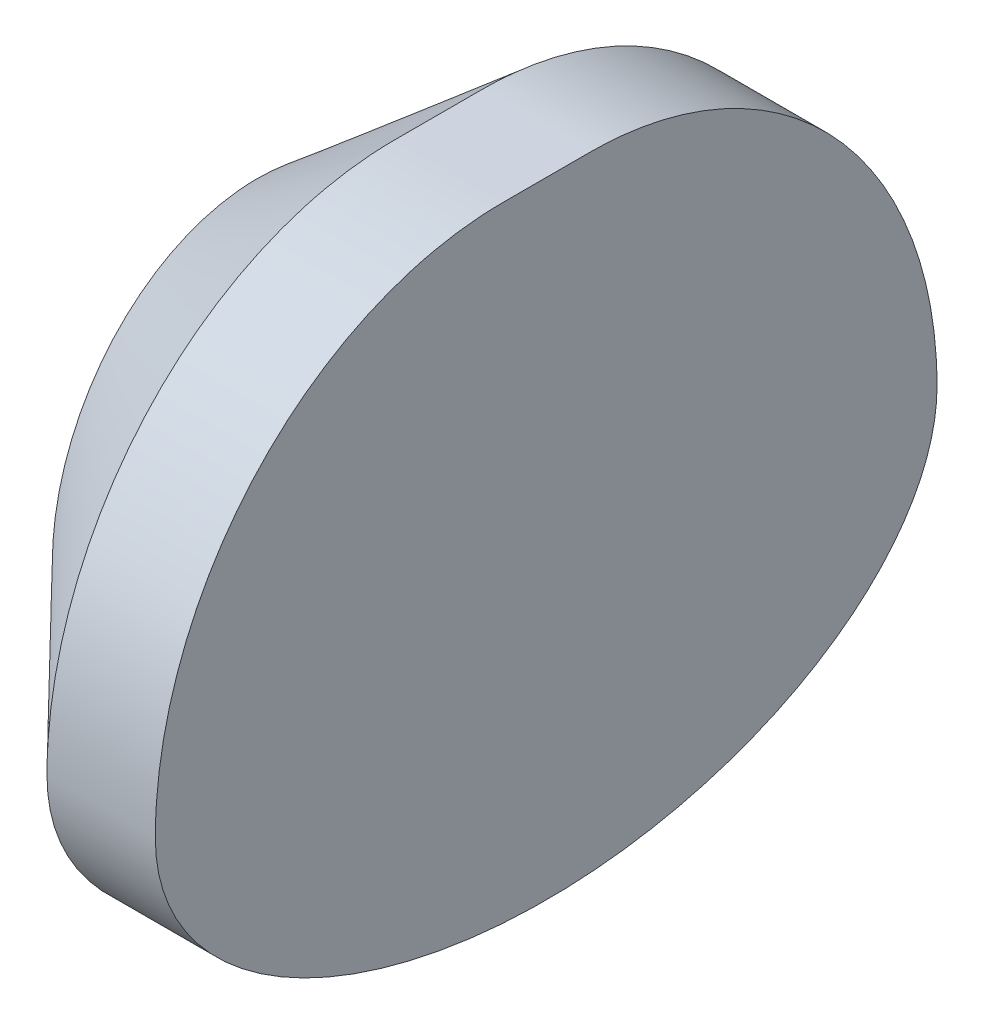
ISO-10303-21;
HEADER;
FILE_DESCRIPTION(('STEP AP214'),'2;1');
FILE_NAME('part.step','',(''),(''),'','','');
FILE_SCHEMA(('AUTOMOTIVE_DESIGN { 1 0 10303 214 1 1 1 1 }'));
ENDSEC;
DATA;
#1=APPLICATION_CONTEXT('core data for automotive mechanical design processes');
#2=APPLICATION_PROTOCOL_DEFINITION('international standard','automotive_design',2000,#1);
#3=PRODUCT_CONTEXT('',#1,'mechanical');
#4=PRODUCT('Part','Part','',(#3));
#5=PRODUCT_RELATED_PRODUCT_CATEGORY('part','',(#4));
#6=PRODUCT_DEFINITION_FORMATION('','',#4);
#7=PRODUCT_DEFINITION_CONTEXT('part definition',#1,'design');
#8=PRODUCT_DEFINITION('design','',#6,#7);
#9=PRODUCT_DEFINITION_SHAPE('','',#8);
#10=(LENGTH_UNIT() NAMED_UNIT(*) SI_UNIT(.MILLI.,.METRE.));
#11=(NAMED_UNIT(*) PLANE_ANGLE_UNIT() SI_UNIT($,.RADIAN.));
#12=(NAMED_UNIT(*) SI_UNIT($,.STERADIAN.) SOLID_ANGLE_UNIT());
#13=UNCERTAINTY_MEASURE_WITH_UNIT(LENGTH_MEASURE(1.E-05),#10,'distance_accuracy_value','');
#14=(GEOMETRIC_REPRESENTATION_CONTEXT(3) GLOBAL_UNCERTAINTY_ASSIGNED_CONTEXT((#13)) GLOBAL_UNIT_ASSIGNED_CONTEXT((#10,
#11,#12)) REPRESENTATION_CONTEXT('',''));
#15=CARTESIAN_POINT('',(0.,0.,0.));
#16=DIRECTION('',(0.,0.,1.));
#17=DIRECTION('',(1.,0.,0.));
#18=AXIS2_PLACEMENT_3D('',#15,#16,#17);
#19=CARTESIAN_POINT('',(0.,0.,0.));
#20=DIRECTION('',(1.,0.,0.));
#21=DIRECTION('',(0.,0.,-1.));
#22=AXIS2_PLACEMENT_3D('',#19,#20,#21);
#23=PLANE('',#22);
#24=CARTESIAN_POINT('',(0.,0.,0.));
#25=DIRECTION('',(1.,0.,0.));
#26=DIRECTION('',(0.,0.,-1.));
#27=AXIS2_PLACEMENT_3D('',#24,#25,#26);
#28=ELLIPSE('',#27,108.250610069917,69.0343094671072);
#29=CARTESIAN_POINT('',(0.,0.,108.250610069917));
#30=VERTEX_POINT('',#29);
#31=CARTESIAN_POINT('',(0.,-2.52169403102978E-09,-108.250610069644));
#32=VERTEX_POINT('',#31);
#33=EDGE_CURVE('E254',#30,#32,#28,.T.);
#34=ORIENTED_EDGE('',*,*,#33,.T.);
#35=CARTESIAN_POINT('',(0.,0.,-12.));
#36=DIRECTION('',(1.,0.,0.));
#37=DIRECTION('',(0.,1.,0.));
#38=AXIS2_PLACEMENT_3D('',#35,#36,#37);
#39=ELLIPSE('',#38,104.280609688491,96.2506100699173);
#40=CARTESIAN_POINT('',(0.,104.280609688491,-11.9999999986268));
#41=VERTEX_POINT('',#40);
#42=EDGE_CURVE('E250',#32,#41,#39,.T.);
#43=ORIENTED_EDGE('',*,*,#42,.T.);
#44=DIRECTION('',(0.,0.,1.));
#45=VECTOR('',#44,1.);
#46=CARTESIAN_POINT('',(0.,104.280609688491,-12.));
#47=LINE('',#46,#45);
#48=CARTESIAN_POINT('',(0.,104.280609688491,12.));
#49=VERTEX_POINT('',#48);
#50=EDGE_CURVE('E233',#41,#49,#47,.T.);
#51=ORIENTED_EDGE('',*,*,#50,.T.);
#52=CARTESIAN_POINT('',(0.,0.,12.));
#53=DIRECTION('',(1.,0.,0.));
#54=DIRECTION('',(0.,1.,0.));
#55=AXIS2_PLACEMENT_3D('',#52,#53,#54);
#56=ELLIPSE('',#55,104.280609688491,96.2506100699173);
#57=EDGE_CURVE('E12',#49,#30,#56,.T.);
#58=ORIENTED_EDGE('',*,*,#57,.T.);
#59=EDGE_LOOP('',(#34,#43,#51,#58));
#60=FACE_BOUND('',#59,.T.);
#61=ADVANCED_FACE('F219',(#60),#23,.T.);
#62=CARTESIAN_POINT('',(0.,104.280609688491,12.0000045013716));
#63=CARTESIAN_POINT('',(-30.,104.280609688491,12.0000045013716));
#64=CARTESIAN_POINT('',(0.,104.280609688491,10.));
#65=CARTESIAN_POINT('',(-30.,104.280609688491,10.));
#66=CARTESIAN_POINT('',(0.,104.280609688491,6.00000000000001));
#67=CARTESIAN_POINT('',(-30.,104.280609688491,6.00000000000001));
#68=CARTESIAN_POINT('',(0.,104.280609688491,0.));
#69=CARTESIAN_POINT('',(-30.,104.280609688491,0.));
#70=CARTESIAN_POINT('',(0.,104.280609688491,-5.99999999999999));
#71=CARTESIAN_POINT('',(-30.,104.280609688491,-5.99999999999999));
#72=CARTESIAN_POINT('',(0.,104.280609688491,-10.));
#73=CARTESIAN_POINT('',(-30.,104.280609688491,-10.));
#74=CARTESIAN_POINT('',(0.,104.280609688491,-18.5649997158969));
#75=CARTESIAN_POINT('',(-30.,104.280609688491,-18.5649997158969));
#76=CARTESIAN_POINT('',(0.,102.817298270843,-31.6942713146222));
#77=CARTESIAN_POINT('',(-29.9999999999999,102.817298270843,-31.6942713146222));
#78=CARTESIAN_POINT('',(0.,96.3830173087808,-50.4320678988774));
#79=CARTESIAN_POINT('',(-30.0000000000001,96.3830173087809,-50.4320678988774));
#80=CARTESIAN_POINT('',(0.,86.1363027743514,-67.3773640878985));
#81=CARTESIAN_POINT('',(-29.9999999999999,86.1363027743514,-67.3773640878985));
#82=CARTESIAN_POINT('',(0.,72.6733257732998,-81.8866282460188));
#83=CARTESIAN_POINT('',(-30.0000000000001,72.6733257732999,-81.8866282460188));
#84=CARTESIAN_POINT('',(0.,56.6659708026067,-93.5130472511675));
#85=CARTESIAN_POINT('',(-29.9999999999999,56.6659708026065,-93.5130472511674));
#86=CARTESIAN_POINT('',(0.,38.7899792325763,-101.973781400399));
#87=CARTESIAN_POINT('',(-30.,38.7899792325764,-101.973781400399));
#88=CARTESIAN_POINT('',(0.,19.6951036442129,-107.104934177411));
#89=CARTESIAN_POINT('',(-30.,19.6951036442128,-107.104934177411));
#90=CARTESIAN_POINT('',(0.,6.56499971589687,-108.250610069917));
#91=CARTESIAN_POINT('',(-30.,6.56499971589687,-108.250610069917));
#92=CARTESIAN_POINT('',(0.,-2.93641305432727,-108.250610069917));
#93=CARTESIAN_POINT('',(-30.,-2.93641305432727,-108.250610069917));
#94=CARTESIAN_POINT('',(0.,-8.80857263521676,-107.65802156483));
#95=CARTESIAN_POINT('',(-30.,-8.80857263521673,-107.65802156483));
#96=CARTESIAN_POINT('',(0.,-17.2745339384963,-105.086315600387));
#97=CARTESIAN_POINT('',(-30.,-17.2745339384963,-105.086315600386));
#98=CARTESIAN_POINT('',(0.,-25.151290681926,-101.075731999929));
#99=CARTESIAN_POINT('',(-30.,-25.151290681926,-101.07573199993));
#100=CARTESIAN_POINT('',(0.,-32.3150186110621,-95.9104366332548));
#101=CARTESIAN_POINT('',(-30.0000000000001,-32.3150186110623,-95.9104366332546));
#102=CARTESIAN_POINT('',(0.,-38.73178328446,-89.8512752283713));
#103=CARTESIAN_POINT('',(-29.9999999999999,-38.7317832844598,-89.8512752283715));
#104=CARTESIAN_POINT('',(0.,-44.4177421832335,-83.1063520688836));
#105=CARTESIAN_POINT('',(-30.0000000000001,-44.4177421832337,-83.1063520688834));
#106=CARTESIAN_POINT('',(0.,-49.4114646466377,-75.8387758370687));
#107=CARTESIAN_POINT('',(-29.9999999999999,-49.4114646466376,-75.8387758370687));
#108=CARTESIAN_POINT('',(0.,-55.2036516480983,-65.6075177527217));
#109=CARTESIAN_POINT('',(-30.0000000000001,-55.2036516480982,-65.6075177527217));
#110=CARTESIAN_POINT('',(0.,-60.9304225908419,-52.0490888699162));
#111=CARTESIAN_POINT('',(-29.9999999999999,-60.9304225908421,-52.0490888699163));
#112=CARTESIAN_POINT('',(0.,-65.6584891697275,-35.044808989351));
#113=CARTESIAN_POINT('',(-30.0000000000001,-65.6584891697274,-35.0448089893508));
#114=CARTESIAN_POINT('',(0.,-68.4264748382489,-17.6185244473056));
#115=CARTESIAN_POINT('',(-29.9999999999998,-68.4264748382489,-17.6185244473057));
#116=CARTESIAN_POINT('',(0.,-69.338097959213,0.));
#117=CARTESIAN_POINT('',(-30.0000000000002,-69.3380979592131,0.));
#118=CARTESIAN_POINT('',(0.,-68.4264748382489,17.618524447306));
#119=CARTESIAN_POINT('',(-29.9999999999997,-68.4264748382488,17.618524447306));
#120=CARTESIAN_POINT('',(0.,-65.6584891697274,35.0448089893509));
#121=CARTESIAN_POINT('',(-30.0000000000002,-65.6584891697274,35.0448089893508));
#122=CARTESIAN_POINT('',(0.,-60.9304225908421,52.0490888699167));
#123=CARTESIAN_POINT('',(-29.9999999999998,-60.9304225908421,52.0490888699167));
#124=CARTESIAN_POINT('',(0.,-55.203651648098,65.6075177527215));
#125=CARTESIAN_POINT('',(-30.0000000000001,-55.2036516480981,65.6075177527216));
#126=CARTESIAN_POINT('',(0.,-49.4114646466377,75.8387758370692));
#127=CARTESIAN_POINT('',(-29.9999999999999,-49.4114646466377,75.8387758370691));
#128=CARTESIAN_POINT('',(0.,-44.4177421832333,83.1063520688834));
#129=CARTESIAN_POINT('',(-30.,-44.4177421832334,83.1063520688833));
#130=CARTESIAN_POINT('',(0.,-38.7317832844598,89.8512752283718));
#131=CARTESIAN_POINT('',(-29.9999999999999,-38.7317832844598,89.8512752283718));
#132=CARTESIAN_POINT('',(0.,-32.3150186110621,95.9104366332548));
#133=CARTESIAN_POINT('',(-30.,-32.315018611062,95.9104366332548));
#134=CARTESIAN_POINT('',(0.,-25.1512906819256,101.075731999929));
#135=CARTESIAN_POINT('',(-30.,-25.1512906819259,101.075731999929));
#136=CARTESIAN_POINT('',(0.,-17.2745339384963,105.086315600387));
#137=CARTESIAN_POINT('',(-30.,-17.2745339384961,105.086315600387));
#138=CARTESIAN_POINT('',(0.,-8.80857263521649,107.658021564829));
#139=CARTESIAN_POINT('',(-30.,-8.80857263521652,107.65802156483));
#140=CARTESIAN_POINT('',(0.,-2.93641305432727,108.250610069917));
#141=CARTESIAN_POINT('',(-30.,-2.93641305432725,108.250610069917));
#142=CARTESIAN_POINT('',(0.,6.56499970384459,108.250610069917));
#143=CARTESIAN_POINT('',(-30.,6.56499970384462,108.250610069917));
#144=CARTESIAN_POINT('',(0.,19.6951036527659,107.104934177602));
#145=CARTESIAN_POINT('',(-29.9999999999999,19.6951036527659,107.104934177602));
#146=CARTESIAN_POINT('',(0.,38.7899792283937,101.97378140005));
#147=CARTESIAN_POINT('',(-30.,38.7899792283937,101.97378140005));
#148=CARTESIAN_POINT('',(0.,56.6659708048007,93.5130472518172));
#149=CARTESIAN_POINT('',(-30.,56.6659708048006,93.5130472518171));
#150=CARTESIAN_POINT('',(0.,72.6733257721366,81.8866282448071));
#151=CARTESIAN_POINT('',(-30.,72.6733257721365,81.8866282448072));
#152=CARTESIAN_POINT('',(0.,86.1363027749674,67.3773640901547));
#153=CARTESIAN_POINT('',(-30.,86.1363027749676,67.3773640901546));
#154=CARTESIAN_POINT('',(0.,96.3830173084529,50.4320678946271));
#155=CARTESIAN_POINT('',(-30.,96.3830173084526,50.4320678946273));
#156=CARTESIAN_POINT('',(0.,102.817298271021,31.6942713232343));
#157=CARTESIAN_POINT('',(-30.,102.817298271022,31.6942713232342));
#158=CARTESIAN_POINT('',(0.,104.280609688491,18.5649997038446));
#159=CARTESIAN_POINT('',(-30.,104.280609688491,18.5649997038446));
#160=CARTESIAN_POINT('',(0.,104.280609688491,12.0000045013716));
#161=CARTESIAN_POINT('',(-30.,104.280609688491,12.0000045013716));
#162=B_SPLINE_SURFACE_WITH_KNOTS('',3,1,((#62,#63),(#64,#65),(#66,#67),(#68,#69),(#70,#71),(#72,
#73),(#74,#75),(#76,#77),(#78,#79),(#80,#81),(#82,#83),(#84,#85),(#86,#87),(#88,#89),(#90,#91),
(#92,#93),(#94,#95),(#96,#97),(#98,#99),(#100,#101),(#102,#103),(#104,#105),(#106,#107),(#108,
#109),(#110,#111),(#112,#113),(#114,#115),(#116,#117),(#118,#119),(#120,#121),(#122,#123),(#124,
#125),(#126,#127),(#128,#129),(#130,#131),(#132,#133),(#134,#135),(#136,#137),(#138,#139),(#140,
#141),(#142,#143),(#144,#145),(#146,#147),(#148,#149),(#150,#151),(#152,#153),(#154,#155),(#156,
#157),(#158,#159),(#160,#161)),.UNSPECIFIED.,.T.,.F.,.F.,(4,1,1,1,2,1,1,1,1,1,1,1,2,1,1,1,1,1,1,
1,1,1,1,1,1,1,1,1,1,1,1,1,1,1,1,1,2,1,1,1,1,1,1,1,4),(2,2),(0.,0.00966128545777721,
0.0193225709155544,0.0289838563733316,0.0386451418311088,0.0703582193035876,0.102071296776066,
0.133784374248545,0.165497451721024,0.197210529193503,0.228923606665982,0.26063668413846,
0.292349761610939,0.306535562819635,0.320721364028332,0.334907165237028,0.349092966445724,
0.36327876765442,0.377464568863117,0.391650370071813,0.405836171280509,0.434207773697902,
0.462579376115294,0.490950978532687,0.519322580950079,0.547694183367472,0.576065785784864,
0.604437388202256,0.632808990619649,0.646994791828345,0.661180593037041,0.675366394245738,
0.689552195454434,0.70373799666313,0.717923797871826,0.732109599080522,0.746295400289219,
0.778008475253066,0.809721550216914,0.841434625180762,0.873147700144609,0.904860775108457,
0.936573850072305,0.968286925036152,1.),(0.,1.),.UNSPECIFIED.);
#163=CARTESIAN_POINT('',(-30.,0.,12.));
#164=DIRECTION('',(1.,0.,0.));
#165=DIRECTION('',(0.,1.,0.));
#166=AXIS2_PLACEMENT_3D('',#163,#164,#165);
#167=ELLIPSE('',#166,104.280609688491,96.2506100699173);
#168=CARTESIAN_POINT('',(-30.,104.280609688491,12.));
#169=VERTEX_POINT('',#168);
#170=CARTESIAN_POINT('',(-30.,0.,108.250610069917));
#171=VERTEX_POINT('',#170);
#172=EDGE_CURVE('E264',#169,#171,#167,.T.);
#173=CARTESIAN_POINT('',(-30.,0.,0.));
#174=DIRECTION('',(1.,0.,0.));
#175=DIRECTION('',(0.,0.,-1.));
#176=AXIS2_PLACEMENT_3D('',#173,#174,#175);
#177=ELLIPSE('',#176,108.250610069917,69.0343094671072);
#178=CARTESIAN_POINT('',(-30.,0.,-108.250610069645));
#179=VERTEX_POINT('',#178);
#180=EDGE_CURVE('E325',#171,#179,#177,.T.);
#181=CARTESIAN_POINT('',(-30.,0.,-12.));
#182=DIRECTION('',(1.,0.,0.));
#183=DIRECTION('',(0.,1.,0.));
#184=AXIS2_PLACEMENT_3D('',#181,#182,#183);
#185=ELLIPSE('',#184,104.280609688491,96.2506100699173);
#186=CARTESIAN_POINT('',(-30.,104.280609688491,-12.));
#187=VERTEX_POINT('',#186);
#188=EDGE_CURVE('E337',#179,#187,#185,.T.);
#189=DIRECTION('',(0.,0.,1.));
#190=VECTOR('',#189,1.);
#191=CARTESIAN_POINT('',(-30.,104.280609688491,-12.));
#192=LINE('',#191,#190);
#193=EDGE_CURVE('E226',#187,#169,#192,.T.);
#194=ORIENTED_EDGE('',*,*,#50,.F.);
#195=ORIENTED_EDGE('',*,*,#42,.F.);
#196=ORIENTED_EDGE('',*,*,#33,.F.);
#197=ORIENTED_EDGE('',*,*,#57,.F.);
#198=EDGE_LOOP('',(#194,#195,#196,#197));
#199=FACE_BOUND('',#198,.T.);
#200=ORIENTED_EDGE('',*,*,#172,.T.);
#201=ORIENTED_EDGE('',*,*,#180,.T.);
#202=ORIENTED_EDGE('',*,*,#188,.T.);
#203=ORIENTED_EDGE('',*,*,#193,.T.);
#204=EDGE_LOOP('',(#200,#201,#202,#203));
#205=FACE_BOUND('',#204,.T.);
#206=ADVANCED_FACE('F221',(#199,#205),#162,.T.);
#207=CARTESIAN_POINT('',(-80.,0.,0.));
#208=DIRECTION('',(-1.,0.,0.));
#209=DIRECTION('',(0.,0.,1.));
#210=AXIS2_PLACEMENT_3D('',#207,#208,#209);
#211=PLANE('',#210);
#212=CARTESIAN_POINT('',(-80.,0.,0.));
#213=DIRECTION('',(1.,0.,0.));
#214=DIRECTION('',(0.,0.,-1.));
#215=AXIS2_PLACEMENT_3D('',#212,#213,#214);
#216=ELLIPSE('',#215,56.7850257255924,39.8401104383333);
#217=CARTESIAN_POINT('',(-80.,0.,56.7850257255924));
#218=VERTEX_POINT('',#217);
#219=CARTESIAN_POINT('',(-80.,0.,-56.7850257255924));
#220=VERTEX_POINT('',#219);
#221=EDGE_CURVE('E385',#218,#220,#216,.T.);
#222=ORIENTED_EDGE('',*,*,#221,.F.);
#223=CARTESIAN_POINT('',(-80.,0.,0.));
#224=DIRECTION('',(1.,0.,0.));
#225=DIRECTION('',(0.,1.,0.));
#226=AXIS2_PLACEMENT_3D('',#223,#224,#225);
#227=ELLIPSE('',#226,64.034444356964,56.7850257255924);
#228=EDGE_CURVE('E379',#220,#218,#227,.T.);
#229=ORIENTED_EDGE('',*,*,#228,.F.);
#230=EDGE_LOOP('',(#222,#229));
#231=FACE_BOUND('',#230,.T.);
#232=ADVANCED_FACE('F282',(#231),#211,.T.);
#233=CARTESIAN_POINT('',(-30.,0.000154269071182475,-108.250610069917));
#234=CARTESIAN_POINT('',(-80.,3.10859499354828E-05,-56.7850257255924));
#235=CARTESIAN_POINT('',(-30.,-2.92102335544548,-108.250610069917));
#236=CARTESIAN_POINT('',(-80.,-1.60170210270246,-56.7850257255924));
#237=CARTESIAN_POINT('',(-30.,-8.76532859820134,-107.664248000249));
#238=CARTESIAN_POINT('',(-80.0000000000001,-4.80330873343349,-56.5081666374398));
#239=CARTESIAN_POINT('',(-30.,-17.201999459513,-105.113876633961));
#240=CARTESIAN_POINT('',(-79.9999999999998,-9.46228590244364,-55.2941361782841));
#241=CARTESIAN_POINT('',(-30.,-25.0621855080917,-101.12909276697));
#242=CARTESIAN_POINT('',(-80.,-13.8658629051846,-53.3652645444365));
#243=CARTESIAN_POINT('',(-30.,-32.2199172676221,-95.9885411560364));
#244=CARTESIAN_POINT('',(-80.,-17.9419361570296,-50.8272957506338));
#245=CARTESIAN_POINT('',(-30.,-38.6384554084994,-89.9498637760191));
#246=CARTESIAN_POINT('',(-80.0000000000001,-21.6528088003659,-47.7912498484992));
#247=CARTESIAN_POINT('',(-30.,-44.3314416338075,-83.2197288458799));
#248=CARTESIAN_POINT('',(-79.9999999999999,-24.9880968838281,-44.3510667342998));
#249=CARTESIAN_POINT('',(-30.,-49.335406174274,-75.9608024148637));
#250=CARTESIAN_POINT('',(-80.,-27.9496199814091,-40.5937611807784));
#251=CARTESIAN_POINT('',(-29.9999999999999,-55.1435735709636,-65.7331032405262));
#252=CARTESIAN_POINT('',(-80.0000000000001,-31.4175100390852,-35.2404263597367));
#253=CARTESIAN_POINT('',(-30.0000000000001,-60.8915949444469,-52.1651358269132));
#254=CARTESIAN_POINT('',(-79.9999999999998,-34.8837573042636,-28.0530861204399));
#255=CARTESIAN_POINT('',(-29.9999999999999,-65.6411468246954,-35.1319719895996));
#256=CARTESIAN_POINT('',(-80.0000000000002,-37.769488894575,-18.936251914091));
#257=CARTESIAN_POINT('',(-30.0000000000001,-68.423223410715,-17.6650564496363));
#258=CARTESIAN_POINT('',(-79.9999999999998,-39.466609650032,-9.53404177042013));
#259=CARTESIAN_POINT('',(-30.,-69.3397254794299,4.05394651355195E-06));
#260=CARTESIAN_POINT('',(-80.0000000000003,-40.0268053108233,-2.18091253216535E-06));
#261=CARTESIAN_POINT('',(-30.,-68.4232225728669,17.6650643864548));
#262=CARTESIAN_POINT('',(-79.9999999999998,-39.4666101600436,9.53403750549484));
#263=CARTESIAN_POINT('',(-30.,-65.6411451985774,35.1319794138164));
#264=CARTESIAN_POINT('',(-80.0000000000002,-37.7694898820071,18.9362479389938));
#265=CARTESIAN_POINT('',(-30.,-60.8915926358353,52.1651424006774));
#266=CARTESIAN_POINT('',(-79.9999999999999,-34.8837586995126,28.0530826257343));
#267=CARTESIAN_POINT('',(-30.,-55.1435708408914,65.7331088313919));
#268=CARTESIAN_POINT('',(-80.0000000000002,-31.4175116766047,35.2404234168034));
#269=CARTESIAN_POINT('',(-30.,-49.3354032478968,75.9608070691958));
#270=CARTESIAN_POINT('',(-80.,-27.949621720854,40.5937587588674));
#271=CARTESIAN_POINT('',(-30.,-44.3314386503647,83.2197327317926));
#272=CARTESIAN_POINT('',(-79.9999999999999,-24.9880986416127,44.351064734406));
#273=CARTESIAN_POINT('',(-30.,-38.6384524810655,89.9498668414378));
#274=CARTESIAN_POINT('',(-80.0000000000001,-21.6528105062272,47.7912482933213));
#275=CARTESIAN_POINT('',(-30.0000000000001,-32.2199145392311,95.988543375302));
#276=CARTESIAN_POINT('',(-80.,-17.9419377252904,50.8272946435172));
#277=CARTESIAN_POINT('',(-29.9999999999999,-25.0621831556198,101.129094159659));
#278=CARTESIAN_POINT('',(-80.,-13.8658642365058,53.3652638629363));
#279=CARTESIAN_POINT('',(-30.,-17.2019976900778,105.113877295365));
#280=CARTESIAN_POINT('',(-80.,-9.46228688836891,55.294135860661));
#281=CARTESIAN_POINT('',(-30.,-8.76532762533649,107.664248134237));
#282=CARTESIAN_POINT('',(-80.,-4.80330926956574,56.5081665739113));
#283=CARTESIAN_POINT('',(-30.,-2.92102302437379,108.250610069917));
#284=CARTESIAN_POINT('',(-80.,-1.60170228551246,56.7850257255924));
#285=CARTESIAN_POINT('',(-30.,6.62656451286608,108.250610069917));
#286=CARTESIAN_POINT('',(-80.,3.6334072017897,56.7850257255924));
#287=CARTESIAN_POINT('',(-30.0000000000001,19.8523762539167,107.083582824892));
#288=CARTESIAN_POINT('',(-80.0000000000001,10.9157384421527,56.2359530698289));
#289=CARTESIAN_POINT('',(-29.9999999999999,39.0120326596848,101.895143852622));
#290=CARTESIAN_POINT('',(-80.0000000000001,21.6204276392835,53.7545868590484));
#291=CARTESIAN_POINT('',(-30.0000000000001,56.8879378330236,93.3814549684525));
#292=CARTESIAN_POINT('',(-79.9999999999999,31.840950999236,49.6049241612877));
#293=CARTESIAN_POINT('',(-29.9999999999999,72.8505828712767,81.7264505025804));
#294=CARTESIAN_POINT('',(-79.9999999999999,41.256636985781,43.8316374262849));
#295=CARTESIAN_POINT('',(-30.,86.2480301526946,67.2227184303525));
#296=CARTESIAN_POINT('',(-80.0000000000002,49.5468140626894,36.4793991037781));
#297=CARTESIAN_POINT('',(-30.,96.4320267340789,50.3158485987649));
#298=CARTESIAN_POINT('',(-80.,56.3287740597918,27.709656900478));
#299=CARTESIAN_POINT('',(-30.,102.825028356017,31.6374809839102));
#300=CARTESIAN_POINT('',(-80.,61.2410162961565,17.7535971609724));
#301=CARTESIAN_POINT('',(-30.,104.280609688491,18.5483969953695));
#302=CARTESIAN_POINT('',(-80.,63.0493510512217,10.5787901741345));
#303=CARTESIAN_POINT('',(-30.,104.280609688491,9.9667946805522));
#304=CARTESIAN_POINT('',(-80.,63.7117560423971,5.80644021038082));
#305=CARTESIAN_POINT('',(-30.,104.280609688491,5.95139527074703));
#306=CARTESIAN_POINT('',(-80.0000000000001,63.9526277281755,3.50775534349167));
#307=CARTESIAN_POINT('',(-30.,104.28060968849,8.59067311211048E-07));
#308=CARTESIAN_POINT('',(-80.,64.0753818275974,-5.18881774352886E-07));
#309=CARTESIAN_POINT('',(-30.,104.280609688491,-5.95139393150489));
#310=CARTESIAN_POINT('',(-80.,63.9526276618675,-3.50775612766598));
#311=CARTESIAN_POINT('',(-30.,104.280609688491,-9.96679412767831));
#312=CARTESIAN_POINT('',(-80.,63.7117560004279,-5.8064405127512));
#313=CARTESIAN_POINT('',(-30.,104.280609688491,-18.5483967322669));
#314=CARTESIAN_POINT('',(-80.,63.049351029244,-10.5787903324751));
#315=CARTESIAN_POINT('',(-30.0000000000001,102.825028467463,-31.6374806207343));
#316=CARTESIAN_POINT('',(-80.,61.2410162063507,-17.7535973566545));
#317=CARTESIAN_POINT('',(-29.9999999999999,96.4320266200583,-50.3158490405045));
#318=CARTESIAN_POINT('',(-80.,56.3287741527554,-27.7096566663865));
#319=CARTESIAN_POINT('',(-30.0000000000001,86.2480291690142,-67.2227198948492));
#320=CARTESIAN_POINT('',(-80.0000000000001,49.5468147060277,-36.4793983519322));
#321=CARTESIAN_POINT('',(-29.9999999999999,72.8505805739526,-81.726452656163));
#322=CARTESIAN_POINT('',(-80.,41.2566383795413,-43.831636335947));
#323=CARTESIAN_POINT('',(-30.,56.8879342774317,-93.381457128609));
#324=CARTESIAN_POINT('',(-80.,31.8409530583759,-49.6049231137972));
#325=CARTESIAN_POINT('',(-29.9999999999999,39.0120285784047,-101.895145336677));
#326=CARTESIAN_POINT('',(-80.,21.6204299307915,-53.7545861393157));
#327=CARTESIAN_POINT('',(-30.,19.8523730246667,-107.083583283708));
#328=CARTESIAN_POINT('',(-80.,10.9157401850475,-56.2359528663356));
#329=CARTESIAN_POINT('',(-30.,6.62656319577385,-108.250610069917));
#330=CARTESIAN_POINT('',(-80.,3.6334079167198,-56.7850257255924));
#331=CARTESIAN_POINT('',(-30.,0.000154269071182475,-108.250610069917));
#332=CARTESIAN_POINT('',(-80.,3.10859499354828E-05,-56.7850257255924));
#333=B_SPLINE_SURFACE_WITH_KNOTS('',3,1,((#233,#234),(#235,#236),(#237,#238),(#239,#240),(#241,
#242),(#243,#244),(#245,#246),(#247,#248),(#249,#250),(#251,#252),(#253,#254),(#255,#256),(#257,
#258),(#259,#260),(#261,#262),(#263,#264),(#265,#266),(#267,#268),(#269,#270),(#271,#272),(#273,
#274),(#275,#276),(#277,#278),(#279,#280),(#281,#282),(#283,#284),(#285,#286),(#287,#288),(#289,
#290),(#291,#292),(#293,#294),(#295,#296),(#297,#298),(#299,#300),(#301,#302),(#303,#304),(#305,
#306),(#307,#308),(#309,#310),(#311,#312),(#313,#314),(#315,#316),(#317,#318),(#319,#320),(#321,
#322),(#323,#324),(#325,#326),(#327,#328),(#329,#330),(#331,#332)),.UNSPECIFIED.,.T.,.F.,.F.,(4,
1,1,1,1,1,1,1,1,1,1,1,1,1,1,1,1,1,1,1,1,1,1,1,2,1,1,1,1,1,1,1,2,1,1,1,2,1,1,1,1,1,1,1,4),(2,2),
(0.,0.0140623790004636,0.0281247580009273,0.0421871370013909,0.0562495160018545,
0.0703118950023182,0.0843742740027818,0.0984366530032454,0.112499032003709,0.140623790004636,
0.168748548005564,0.196873306006491,0.224998064007418,0.253122822008345,0.281247580009273,
0.3093723380102,0.337497096011127,0.351559475011591,0.365621854012054,0.379684233012518,
0.393746612012982,0.407808991013445,0.421871370013909,0.435933749014373,0.449996128014836,
0.48189528225992,0.513794436505005,0.545693590750089,0.577592744995173,0.609491899240257,
0.641391053485341,0.673290207730425,0.70518936197551,0.715093727973365,0.72499809397122,
0.734902459969075,0.74480682596693,0.776705972721064,0.808605119475198,0.840504266229331,
0.872403412983465,0.904302559737599,0.936201706491733,0.968100853245866,1.),(0.,1.),.UNSPECIFIED.);
#334=ORIENTED_EDGE('',*,*,#193,.F.);
#335=ORIENTED_EDGE('',*,*,#188,.F.);
#336=ORIENTED_EDGE('',*,*,#180,.F.);
#337=ORIENTED_EDGE('',*,*,#172,.F.);
#338=EDGE_LOOP('',(#334,#335,#336,#337));
#339=FACE_BOUND('',#338,.T.);
#340=ORIENTED_EDGE('',*,*,#228,.T.);
#341=ORIENTED_EDGE('',*,*,#221,.T.);
#342=EDGE_LOOP('',(#340,#341));
#343=FACE_BOUND('',#342,.T.);
#344=ADVANCED_FACE('F411',(#339,#343),#333,.T.);
#345=CLOSED_SHELL('',(#61,#206,#232,#344));
#346=MANIFOLD_SOLID_BREP('B2',#345);
#347=ADVANCED_BREP_SHAPE_REPRESENTATION('',(#18,#346),#14);
#348=SHAPE_DEFINITION_REPRESENTATION(#9,#347);
ENDSEC;
END-ISO-10303-21;
